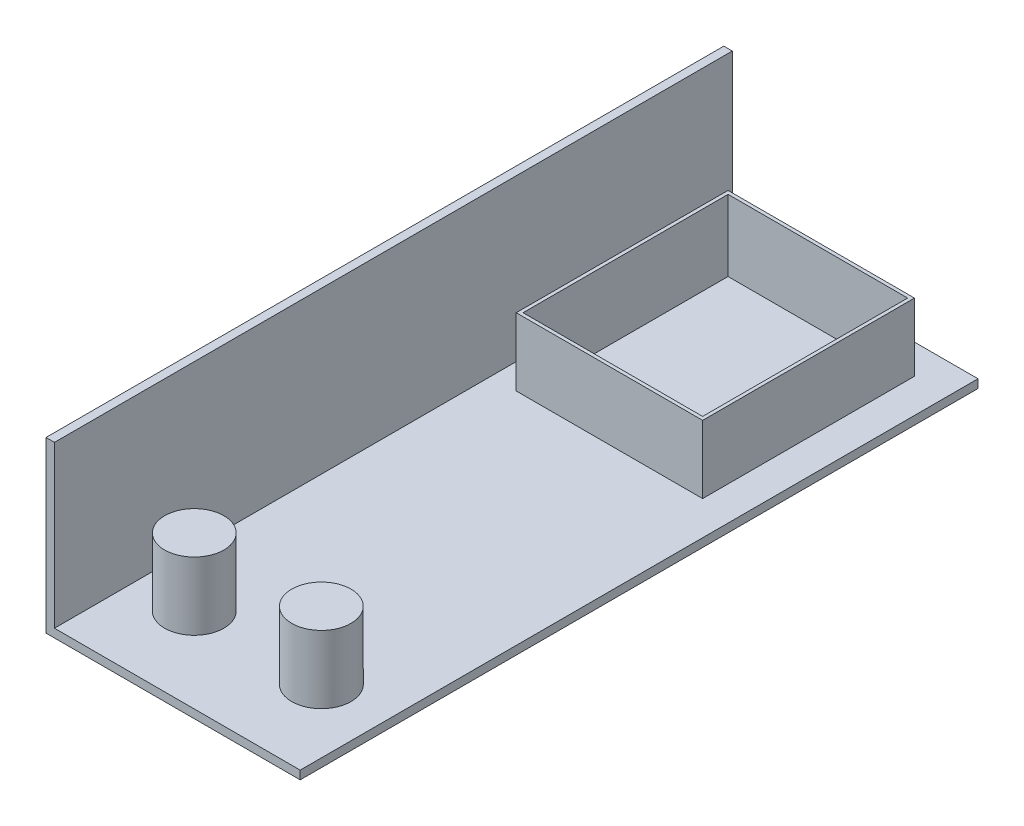
ISO-10303-21;
HEADER;
FILE_DESCRIPTION(('STEP AP214'),'2;1');
FILE_NAME('part.step','',(''),(''),'','','');
FILE_SCHEMA(('AUTOMOTIVE_DESIGN { 1 0 10303 214 1 1 1 1 }'));
ENDSEC;
DATA;
#1=APPLICATION_CONTEXT('core data for automotive mechanical design processes');
#2=APPLICATION_PROTOCOL_DEFINITION('international standard','automotive_design',2000,#1);
#3=PRODUCT_CONTEXT('',#1,'mechanical');
#4=PRODUCT('Part','Part','',(#3));
#5=PRODUCT_RELATED_PRODUCT_CATEGORY('part','',(#4));
#6=PRODUCT_DEFINITION_FORMATION('','',#4);
#7=PRODUCT_DEFINITION_CONTEXT('part definition',#1,'design');
#8=PRODUCT_DEFINITION('design','',#6,#7);
#9=PRODUCT_DEFINITION_SHAPE('','',#8);
#10=(LENGTH_UNIT() NAMED_UNIT(*) SI_UNIT(.MILLI.,.METRE.));
#11=(NAMED_UNIT(*) PLANE_ANGLE_UNIT() SI_UNIT($,.RADIAN.));
#12=(NAMED_UNIT(*) SI_UNIT($,.STERADIAN.) SOLID_ANGLE_UNIT());
#13=UNCERTAINTY_MEASURE_WITH_UNIT(LENGTH_MEASURE(1.E-05),#10,'distance_accuracy_value','');
#14=(GEOMETRIC_REPRESENTATION_CONTEXT(3) GLOBAL_UNCERTAINTY_ASSIGNED_CONTEXT((#13)) GLOBAL_UNIT_ASSIGNED_CONTEXT((#10,
#11,#12)) REPRESENTATION_CONTEXT('',''));
#15=CARTESIAN_POINT('',(0.,0.,0.));
#16=DIRECTION('',(0.,0.,1.));
#17=DIRECTION('',(1.,0.,0.));
#18=AXIS2_PLACEMENT_3D('',#15,#16,#17);
#19=CARTESIAN_POINT('',(0.,45.,0.));
#20=DIRECTION('',(0.,-1.,0.));
#21=DIRECTION('',(1.,0.,0.));
#22=AXIS2_PLACEMENT_3D('',#19,#20,#21);
#23=PLANE('',#22);
#24=DIRECTION('',(0.,0.,-1.));
#25=VECTOR('',#24,1.);
#26=CARTESIAN_POINT('',(55.,45.,-57.5));
#27=LINE('',#26,#25);
#28=CARTESIAN_POINT('',(55.,45.,-57.5));
#29=VERTEX_POINT('',#28);
#30=CARTESIAN_POINT('',(55.,45.,-182.5));
#31=VERTEX_POINT('',#30);
#32=EDGE_CURVE('E230',#29,#31,#27,.T.);
#33=ORIENTED_EDGE('',*,*,#32,.T.);
#34=DIRECTION('',(-1.,0.,0.));
#35=VECTOR('',#34,1.);
#36=CARTESIAN_POINT('',(-55.,45.,-182.5));
#37=LINE('',#36,#35);
#38=CARTESIAN_POINT('',(-55.,45.,-182.5));
#39=VERTEX_POINT('',#38);
#40=EDGE_CURVE('E233',#31,#39,#37,.T.);
#41=ORIENTED_EDGE('',*,*,#40,.T.);
#42=DIRECTION('',(0.,0.,1.));
#43=VECTOR('',#42,1.);
#44=CARTESIAN_POINT('',(-55.,45.,-57.5));
#45=LINE('',#44,#43);
#46=CARTESIAN_POINT('',(-55.,45.,-57.5));
#47=VERTEX_POINT('',#46);
#48=EDGE_CURVE('E236',#39,#47,#45,.T.);
#49=ORIENTED_EDGE('',*,*,#48,.T.);
#50=DIRECTION('',(1.,0.,0.));
#51=VECTOR('',#50,1.);
#52=CARTESIAN_POINT('',(-55.,45.,-57.5));
#53=LINE('',#52,#51);
#54=EDGE_CURVE('E238',#47,#29,#53,.T.);
#55=ORIENTED_EDGE('',*,*,#54,.T.);
#56=EDGE_LOOP('',(#33,#41,#49,#55));
#57=FACE_BOUND('',#56,.T.);
#58=DIRECTION('',(0.,0.,-1.));
#59=VECTOR('',#58,1.);
#60=CARTESIAN_POINT('',(53.,45.,0.));
#61=LINE('',#60,#59);
#62=CARTESIAN_POINT('',(53.,45.,-59.5));
#63=VERTEX_POINT('',#62);
#64=CARTESIAN_POINT('',(53.,45.,-180.5));
#65=VERTEX_POINT('',#64);
#66=EDGE_CURVE('E222',#63,#65,#61,.T.);
#67=ORIENTED_EDGE('',*,*,#66,.F.);
#68=DIRECTION('',(1.,0.,0.));
#69=VECTOR('',#68,1.);
#70=CARTESIAN_POINT('',(0.,45.,-59.5));
#71=LINE('',#70,#69);
#72=CARTESIAN_POINT('',(-53.,45.,-59.5));
#73=VERTEX_POINT('',#72);
#74=EDGE_CURVE('E218',#73,#63,#71,.T.);
#75=ORIENTED_EDGE('',*,*,#74,.F.);
#76=DIRECTION('',(0.,0.,1.));
#77=VECTOR('',#76,1.);
#78=CARTESIAN_POINT('',(-53.,45.,0.));
#79=LINE('',#78,#77);
#80=CARTESIAN_POINT('',(-53.,45.,-180.5));
#81=VERTEX_POINT('',#80);
#82=EDGE_CURVE('E227',#81,#73,#79,.T.);
#83=ORIENTED_EDGE('',*,*,#82,.F.);
#84=DIRECTION('',(-1.,0.,0.));
#85=VECTOR('',#84,1.);
#86=CARTESIAN_POINT('',(0.,45.,-180.5));
#87=LINE('',#86,#85);
#88=EDGE_CURVE('E224',#65,#81,#87,.T.);
#89=ORIENTED_EDGE('',*,*,#88,.F.);
#90=EDGE_LOOP('',(#67,#75,#83,#89));
#91=FACE_BOUND('',#90,.T.);
#92=ADVANCED_FACE('F32',(#57,#91),#23,.F.);
#93=CARTESIAN_POINT('',(75.,5.,200.));
#94=DIRECTION('',(0.,-1.,0.));
#95=DIRECTION('',(1.,0.,0.));
#96=AXIS2_PLACEMENT_3D('',#93,#94,#95);
#97=PLANE('',#96);
#98=CARTESIAN_POINT('',(-37.5,4.99999999999999,150.));
#99=DIRECTION('',(0.,-1.,0.));
#100=DIRECTION('',(1.,0.,0.));
#101=AXIS2_PLACEMENT_3D('',#98,#99,#100);
#102=CIRCLE('',#101,17.5);
#103=CARTESIAN_POINT('',(-20.,4.99999999999999,150.));
#104=VERTEX_POINT('',#103);
#105=EDGE_CURVE('E11',#104,#104,#102,.F.);
#106=ORIENTED_EDGE('',*,*,#105,.F.);
#107=EDGE_LOOP('',(#106));
#108=FACE_BOUND('',#107,.T.);
#109=DIRECTION('',(-1.,0.,0.));
#110=VECTOR('',#109,1.);
#111=CARTESIAN_POINT('',(75.,5.,-200.));
#112=LINE('',#111,#110);
#113=CARTESIAN_POINT('',(75.,5.,-200.));
#114=VERTEX_POINT('',#113);
#115=CARTESIAN_POINT('',(-70.,4.99999999999999,-200.));
#116=VERTEX_POINT('',#115);
#117=EDGE_CURVE('E291',#114,#116,#112,.T.);
#118=ORIENTED_EDGE('',*,*,#117,.T.);
#119=DIRECTION('',(0.,0.,-1.));
#120=VECTOR('',#119,1.);
#121=CARTESIAN_POINT('',(-70.,4.99999999999999,200.));
#122=LINE('',#121,#120);
#123=CARTESIAN_POINT('',(-70.,4.99999999999999,200.));
#124=VERTEX_POINT('',#123);
#125=EDGE_CURVE('E296',#124,#116,#122,.T.);
#126=ORIENTED_EDGE('',*,*,#125,.F.);
#127=DIRECTION('',(-1.,0.,0.));
#128=VECTOR('',#127,1.);
#129=CARTESIAN_POINT('',(75.,5.,200.));
#130=LINE('',#129,#128);
#131=CARTESIAN_POINT('',(75.,5.,200.));
#132=VERTEX_POINT('',#131);
#133=EDGE_CURVE('E278',#132,#124,#130,.T.);
#134=ORIENTED_EDGE('',*,*,#133,.F.);
#135=DIRECTION('',(0.,0.,-1.));
#136=VECTOR('',#135,1.);
#137=CARTESIAN_POINT('',(75.,5.,200.));
#138=LINE('',#137,#136);
#139=EDGE_CURVE('E299',#132,#114,#138,.T.);
#140=ORIENTED_EDGE('',*,*,#139,.T.);
#141=EDGE_LOOP('',(#118,#126,#134,#140));
#142=FACE_BOUND('',#141,.T.);
#143=CARTESIAN_POINT('',(37.5,5.,150.));
#144=DIRECTION('',(0.,-1.,0.));
#145=DIRECTION('',(1.,0.,0.));
#146=AXIS2_PLACEMENT_3D('',#143,#144,#145);
#147=CIRCLE('',#146,17.5);
#148=CARTESIAN_POINT('',(55.,5.,150.));
#149=VERTEX_POINT('',#148);
#150=EDGE_CURVE('E40',#149,#149,#147,.F.);
#151=ORIENTED_EDGE('',*,*,#150,.F.);
#152=EDGE_LOOP('',(#151));
#153=FACE_BOUND('',#152,.T.);
#154=DIRECTION('',(0.,0.,-1.));
#155=VECTOR('',#154,1.);
#156=CARTESIAN_POINT('',(55.,5.,-57.5));
#157=LINE('',#156,#155);
#158=CARTESIAN_POINT('',(55.,5.,-57.5));
#159=VERTEX_POINT('',#158);
#160=CARTESIAN_POINT('',(55.,5.,-182.5));
#161=VERTEX_POINT('',#160);
#162=EDGE_CURVE('E241',#159,#161,#157,.T.);
#163=ORIENTED_EDGE('',*,*,#162,.F.);
#164=DIRECTION('',(1.,0.,0.));
#165=VECTOR('',#164,1.);
#166=CARTESIAN_POINT('',(-55.,4.99999999999999,-57.5));
#167=LINE('',#166,#165);
#168=CARTESIAN_POINT('',(-55.,4.99999999999999,-57.5));
#169=VERTEX_POINT('',#168);
#170=EDGE_CURVE('E234',#169,#159,#167,.T.);
#171=ORIENTED_EDGE('',*,*,#170,.F.);
#172=DIRECTION('',(0.,0.,1.));
#173=VECTOR('',#172,1.);
#174=CARTESIAN_POINT('',(-55.,4.99999999999999,-57.5));
#175=LINE('',#174,#173);
#176=CARTESIAN_POINT('',(-55.,4.99999999999999,-182.5));
#177=VERTEX_POINT('',#176);
#178=EDGE_CURVE('E246',#177,#169,#175,.T.);
#179=ORIENTED_EDGE('',*,*,#178,.F.);
#180=DIRECTION('',(-1.,0.,0.));
#181=VECTOR('',#180,1.);
#182=CARTESIAN_POINT('',(-55.,4.99999999999999,-182.5));
#183=LINE('',#182,#181);
#184=EDGE_CURVE('E55',#161,#177,#183,.T.);
#185=ORIENTED_EDGE('',*,*,#184,.F.);
#186=EDGE_LOOP('',(#163,#171,#179,#185));
#187=FACE_BOUND('',#186,.T.);
#188=ADVANCED_FACE('F315',(#108,#142,#153,#187),#97,.F.);
#189=CARTESIAN_POINT('',(-70.,100.,200.));
#190=DIRECTION('',(0.,-1.,0.));
#191=DIRECTION('',(1.,0.,0.));
#192=AXIS2_PLACEMENT_3D('',#189,#190,#191);
#193=PLANE('',#192);
#194=DIRECTION('',(-1.,0.,0.));
#195=VECTOR('',#194,1.);
#196=CARTESIAN_POINT('',(-70.,100.,-200.));
#197=LINE('',#196,#195);
#198=CARTESIAN_POINT('',(-70.,100.,-200.));
#199=VERTEX_POINT('',#198);
#200=CARTESIAN_POINT('',(-75.,100.,-200.));
#201=VERTEX_POINT('',#200);
#202=EDGE_CURVE('E267',#199,#201,#197,.T.);
#203=ORIENTED_EDGE('',*,*,#202,.T.);
#204=DIRECTION('',(0.,0.,-1.));
#205=VECTOR('',#204,1.);
#206=CARTESIAN_POINT('',(-75.,100.,200.));
#207=LINE('',#206,#205);
#208=CARTESIAN_POINT('',(-75.,100.,200.));
#209=VERTEX_POINT('',#208);
#210=EDGE_CURVE('E308',#209,#201,#207,.T.);
#211=ORIENTED_EDGE('',*,*,#210,.F.);
#212=DIRECTION('',(-1.,0.,0.));
#213=VECTOR('',#212,1.);
#214=CARTESIAN_POINT('',(-70.,100.,200.));
#215=LINE('',#214,#213);
#216=CARTESIAN_POINT('',(-70.,100.,200.));
#217=VERTEX_POINT('',#216);
#218=EDGE_CURVE('E268',#217,#209,#215,.T.);
#219=ORIENTED_EDGE('',*,*,#218,.F.);
#220=DIRECTION('',(0.,0.,-1.));
#221=VECTOR('',#220,1.);
#222=CARTESIAN_POINT('',(-70.,100.,200.));
#223=LINE('',#222,#221);
#224=EDGE_CURVE('E282',#217,#199,#223,.T.);
#225=ORIENTED_EDGE('',*,*,#224,.T.);
#226=EDGE_LOOP('',(#203,#211,#219,#225));
#227=FACE_BOUND('',#226,.T.);
#228=ADVANCED_FACE('F34',(#227),#193,.F.);
#229=CARTESIAN_POINT('',(-75.,100.,200.));
#230=DIRECTION('',(1.,0.,0.));
#231=DIRECTION('',(0.,1.,0.));
#232=AXIS2_PLACEMENT_3D('',#229,#230,#231);
#233=PLANE('',#232);
#234=DIRECTION('',(0.,-1.,0.));
#235=VECTOR('',#234,1.);
#236=CARTESIAN_POINT('',(-75.,100.,-200.));
#237=LINE('',#236,#235);
#238=CARTESIAN_POINT('',(-75.,0.,-200.));
#239=VERTEX_POINT('',#238);
#240=EDGE_CURVE('E285',#201,#239,#237,.T.);
#241=ORIENTED_EDGE('',*,*,#240,.T.);
#242=DIRECTION('',(0.,0.,-1.));
#243=VECTOR('',#242,1.);
#244=CARTESIAN_POINT('',(-75.,0.,200.));
#245=LINE('',#244,#243);
#246=CARTESIAN_POINT('',(-75.,0.,200.));
#247=VERTEX_POINT('',#246);
#248=EDGE_CURVE('E305',#247,#239,#245,.T.);
#249=ORIENTED_EDGE('',*,*,#248,.F.);
#250=DIRECTION('',(0.,-1.,0.));
#251=VECTOR('',#250,1.);
#252=CARTESIAN_POINT('',(-75.,100.,200.));
#253=LINE('',#252,#251);
#254=EDGE_CURVE('E271',#209,#247,#253,.T.);
#255=ORIENTED_EDGE('',*,*,#254,.F.);
#256=ORIENTED_EDGE('',*,*,#210,.T.);
#257=EDGE_LOOP('',(#241,#249,#255,#256));
#258=FACE_BOUND('',#257,.T.);
#259=ADVANCED_FACE('F679',(#258),#233,.F.);
#260=CARTESIAN_POINT('',(-75.,0.,200.));
#261=DIRECTION('',(0.,1.,0.));
#262=DIRECTION('',(-1.,0.,0.));
#263=AXIS2_PLACEMENT_3D('',#260,#261,#262);
#264=PLANE('',#263);
#265=DIRECTION('',(1.,0.,0.));
#266=VECTOR('',#265,1.);
#267=CARTESIAN_POINT('',(-75.,0.,-200.));
#268=LINE('',#267,#266);
#269=CARTESIAN_POINT('',(75.,0.,-200.));
#270=VERTEX_POINT('',#269);
#271=EDGE_CURVE('E287',#239,#270,#268,.T.);
#272=ORIENTED_EDGE('',*,*,#271,.T.);
#273=DIRECTION('',(0.,0.,-1.));
#274=VECTOR('',#273,1.);
#275=CARTESIAN_POINT('',(75.,0.,200.));
#276=LINE('',#275,#274);
#277=CARTESIAN_POINT('',(75.,0.,200.));
#278=VERTEX_POINT('',#277);
#279=EDGE_CURVE('E302',#278,#270,#276,.T.);
#280=ORIENTED_EDGE('',*,*,#279,.F.);
#281=DIRECTION('',(1.,0.,0.));
#282=VECTOR('',#281,1.);
#283=CARTESIAN_POINT('',(-75.,0.,200.));
#284=LINE('',#283,#282);
#285=EDGE_CURVE('E274',#247,#278,#284,.T.);
#286=ORIENTED_EDGE('',*,*,#285,.F.);
#287=ORIENTED_EDGE('',*,*,#248,.T.);
#288=EDGE_LOOP('',(#272,#280,#286,#287));
#289=FACE_BOUND('',#288,.T.);
#290=ADVANCED_FACE('F669',(#289),#264,.F.);
#291=CARTESIAN_POINT('',(75.,5.,200.));
#292=DIRECTION('',(-1.,0.,0.));
#293=DIRECTION('',(0.,0.,1.));
#294=AXIS2_PLACEMENT_3D('',#291,#292,#293);
#295=PLANE('',#294);
#296=DIRECTION('',(0.,1.,0.));
#297=VECTOR('',#296,1.);
#298=CARTESIAN_POINT('',(75.,5.,-200.));
#299=LINE('',#298,#297);
#300=EDGE_CURVE('E289',#270,#114,#299,.T.);
#301=ORIENTED_EDGE('',*,*,#300,.T.);
#302=ORIENTED_EDGE('',*,*,#139,.F.);
#303=DIRECTION('',(0.,1.,0.));
#304=VECTOR('',#303,1.);
#305=CARTESIAN_POINT('',(75.,5.,200.));
#306=LINE('',#305,#304);
#307=EDGE_CURVE('E276',#278,#132,#306,.T.);
#308=ORIENTED_EDGE('',*,*,#307,.F.);
#309=ORIENTED_EDGE('',*,*,#279,.T.);
#310=EDGE_LOOP('',(#301,#302,#308,#309));
#311=FACE_BOUND('',#310,.T.);
#312=ADVANCED_FACE('F659',(#311),#295,.F.);
#313=CARTESIAN_POINT('',(-70.,4.99999999999999,200.));
#314=DIRECTION('',(-1.,0.,0.));
#315=DIRECTION('',(0.,0.,1.));
#316=AXIS2_PLACEMENT_3D('',#313,#314,#315);
#317=PLANE('',#316);
#318=DIRECTION('',(0.,1.,0.));
#319=VECTOR('',#318,1.);
#320=CARTESIAN_POINT('',(-70.,4.99999999999999,-200.));
#321=LINE('',#320,#319);
#322=EDGE_CURVE('E272',#116,#199,#321,.T.);
#323=ORIENTED_EDGE('',*,*,#322,.T.);
#324=ORIENTED_EDGE('',*,*,#224,.F.);
#325=DIRECTION('',(0.,1.,0.));
#326=VECTOR('',#325,1.);
#327=CARTESIAN_POINT('',(-70.,4.99999999999999,200.));
#328=LINE('',#327,#326);
#329=EDGE_CURVE('E280',#124,#217,#328,.T.);
#330=ORIENTED_EDGE('',*,*,#329,.F.);
#331=ORIENTED_EDGE('',*,*,#125,.T.);
#332=EDGE_LOOP('',(#323,#324,#330,#331));
#333=FACE_BOUND('',#332,.T.);
#334=ADVANCED_FACE('F649',(#333),#317,.F.);
#335=CARTESIAN_POINT('',(0.,0.,200.));
#336=DIRECTION('',(0.,0.,1.));
#337=DIRECTION('',(1.,0.,0.));
#338=AXIS2_PLACEMENT_3D('',#335,#336,#337);
#339=PLANE('',#338);
#340=ORIENTED_EDGE('',*,*,#218,.T.);
#341=ORIENTED_EDGE('',*,*,#254,.T.);
#342=ORIENTED_EDGE('',*,*,#285,.T.);
#343=ORIENTED_EDGE('',*,*,#307,.T.);
#344=ORIENTED_EDGE('',*,*,#133,.T.);
#345=ORIENTED_EDGE('',*,*,#329,.T.);
#346=EDGE_LOOP('',(#340,#341,#342,#343,#344,#345));
#347=FACE_BOUND('',#346,.T.);
#348=ADVANCED_FACE('F639',(#347),#339,.T.);
#349=CARTESIAN_POINT('',(0.,0.,-200.));
#350=DIRECTION('',(0.,0.,1.));
#351=DIRECTION('',(1.,0.,0.));
#352=AXIS2_PLACEMENT_3D('',#349,#350,#351);
#353=PLANE('',#352);
#354=ORIENTED_EDGE('',*,*,#202,.F.);
#355=ORIENTED_EDGE('',*,*,#322,.F.);
#356=ORIENTED_EDGE('',*,*,#117,.F.);
#357=ORIENTED_EDGE('',*,*,#300,.F.);
#358=ORIENTED_EDGE('',*,*,#271,.F.);
#359=ORIENTED_EDGE('',*,*,#240,.F.);
#360=EDGE_LOOP('',(#354,#355,#356,#357,#358,#359));
#361=FACE_BOUND('',#360,.T.);
#362=ADVANCED_FACE('F629',(#361),#353,.F.);
#363=CARTESIAN_POINT('',(37.5,45.,150.));
#364=DIRECTION('',(0.,-1.,0.));
#365=DIRECTION('',(1.,0.,0.));
#366=AXIS2_PLACEMENT_3D('',#363,#364,#365);
#367=CYLINDRICAL_SURFACE('',#366,17.5);
#368=CARTESIAN_POINT('',(37.5,45.,150.));
#369=DIRECTION('',(0.,1.,0.));
#370=DIRECTION('',(-1.,0.,0.));
#371=AXIS2_PLACEMENT_3D('',#368,#369,#370);
#372=CIRCLE('',#371,17.5);
#373=CARTESIAN_POINT('',(20.,45.,150.));
#374=VERTEX_POINT('',#373);
#375=EDGE_CURVE('E264',#374,#374,#372,.T.);
#376=ORIENTED_EDGE('',*,*,#375,.F.);
#377=EDGE_LOOP('',(#376));
#378=FACE_BOUND('',#377,.T.);
#379=ORIENTED_EDGE('',*,*,#150,.T.);
#380=EDGE_LOOP('',(#379));
#381=FACE_BOUND('',#380,.T.);
#382=ADVANCED_FACE('F313',(#378,#381),#367,.T.);
#383=CARTESIAN_POINT('',(37.5,45.,150.));
#384=DIRECTION('',(0.,1.,0.));
#385=DIRECTION('',(-1.,0.,0.));
#386=AXIS2_PLACEMENT_3D('',#383,#384,#385);
#387=PLANE('',#386);
#388=ORIENTED_EDGE('',*,*,#375,.T.);
#389=EDGE_LOOP('',(#388));
#390=FACE_BOUND('',#389,.T.);
#391=ADVANCED_FACE('F610',(#390),#387,.T.);
#392=CARTESIAN_POINT('',(-37.5,45.,150.));
#393=DIRECTION('',(0.,-1.,0.));
#394=DIRECTION('',(1.,0.,0.));
#395=AXIS2_PLACEMENT_3D('',#392,#393,#394);
#396=CYLINDRICAL_SURFACE('',#395,17.5);
#397=CARTESIAN_POINT('',(-37.5,45.,150.));
#398=DIRECTION('',(0.,1.,0.));
#399=DIRECTION('',(-1.,0.,0.));
#400=AXIS2_PLACEMENT_3D('',#397,#398,#399);
#401=CIRCLE('',#400,17.5);
#402=CARTESIAN_POINT('',(-55.,45.,150.));
#403=VERTEX_POINT('',#402);
#404=EDGE_CURVE('E261',#403,#403,#401,.T.);
#405=ORIENTED_EDGE('',*,*,#404,.F.);
#406=EDGE_LOOP('',(#405));
#407=FACE_BOUND('',#406,.T.);
#408=ORIENTED_EDGE('',*,*,#105,.T.);
#409=EDGE_LOOP('',(#408));
#410=FACE_BOUND('',#409,.T.);
#411=ADVANCED_FACE('F600',(#407,#410),#396,.T.);
#412=CARTESIAN_POINT('',(-37.5,45.,150.));
#413=DIRECTION('',(0.,1.,0.));
#414=DIRECTION('',(-1.,0.,0.));
#415=AXIS2_PLACEMENT_3D('',#412,#413,#414);
#416=PLANE('',#415);
#417=ORIENTED_EDGE('',*,*,#404,.T.);
#418=EDGE_LOOP('',(#417));
#419=FACE_BOUND('',#418,.T.);
#420=ADVANCED_FACE('F343',(#419),#416,.T.);
#421=CARTESIAN_POINT('',(55.,45.,-57.5));
#422=DIRECTION('',(-1.,0.,0.));
#423=DIRECTION('',(0.,-1.,0.));
#424=AXIS2_PLACEMENT_3D('',#421,#422,#423);
#425=PLANE('',#424);
#426=ORIENTED_EDGE('',*,*,#162,.T.);
#427=DIRECTION('',(0.,-1.,0.));
#428=VECTOR('',#427,1.);
#429=CARTESIAN_POINT('',(55.,45.,-182.5));
#430=LINE('',#429,#428);
#431=EDGE_CURVE('E259',#31,#161,#430,.T.);
#432=ORIENTED_EDGE('',*,*,#431,.F.);
#433=ORIENTED_EDGE('',*,*,#32,.F.);
#434=DIRECTION('',(0.,-1.,0.));
#435=VECTOR('',#434,1.);
#436=CARTESIAN_POINT('',(55.,45.,-57.5));
#437=LINE('',#436,#435);
#438=EDGE_CURVE('E240',#29,#159,#437,.T.);
#439=ORIENTED_EDGE('',*,*,#438,.T.);
#440=EDGE_LOOP('',(#426,#432,#433,#439));
#441=FACE_BOUND('',#440,.T.);
#442=ADVANCED_FACE('F327',(#441),#425,.F.);
#443=CARTESIAN_POINT('',(-55.,45.,-182.5));
#444=DIRECTION('',(0.,0.,1.));
#445=DIRECTION('',(1.,0.,0.));
#446=AXIS2_PLACEMENT_3D('',#443,#444,#445);
#447=PLANE('',#446);
#448=ORIENTED_EDGE('',*,*,#184,.T.);
#449=DIRECTION('',(0.,-1.,0.));
#450=VECTOR('',#449,1.);
#451=CARTESIAN_POINT('',(-55.,45.,-182.5));
#452=LINE('',#451,#450);
#453=EDGE_CURVE('E256',#39,#177,#452,.T.);
#454=ORIENTED_EDGE('',*,*,#453,.F.);
#455=ORIENTED_EDGE('',*,*,#40,.F.);
#456=ORIENTED_EDGE('',*,*,#431,.T.);
#457=EDGE_LOOP('',(#448,#454,#455,#456));
#458=FACE_BOUND('',#457,.T.);
#459=ADVANCED_FACE('F335',(#458),#447,.F.);
#460=CARTESIAN_POINT('',(-55.,45.,-57.5));
#461=DIRECTION('',(1.,0.,0.));
#462=DIRECTION('',(0.,1.,0.));
#463=AXIS2_PLACEMENT_3D('',#460,#461,#462);
#464=PLANE('',#463);
#465=ORIENTED_EDGE('',*,*,#178,.T.);
#466=DIRECTION('',(0.,-1.,0.));
#467=VECTOR('',#466,1.);
#468=CARTESIAN_POINT('',(-55.,45.,-57.5));
#469=LINE('',#468,#467);
#470=EDGE_CURVE('E253',#47,#169,#469,.T.);
#471=ORIENTED_EDGE('',*,*,#470,.F.);
#472=ORIENTED_EDGE('',*,*,#48,.F.);
#473=ORIENTED_EDGE('',*,*,#453,.T.);
#474=EDGE_LOOP('',(#465,#471,#472,#473));
#475=FACE_BOUND('',#474,.T.);
#476=ADVANCED_FACE('F333',(#475),#464,.F.);
#477=CARTESIAN_POINT('',(-55.,45.,-57.5));
#478=DIRECTION('',(0.,0.,-1.));
#479=DIRECTION('',(-1.,0.,0.));
#480=AXIS2_PLACEMENT_3D('',#477,#478,#479);
#481=PLANE('',#480);
#482=ORIENTED_EDGE('',*,*,#170,.T.);
#483=ORIENTED_EDGE('',*,*,#438,.F.);
#484=ORIENTED_EDGE('',*,*,#54,.F.);
#485=ORIENTED_EDGE('',*,*,#470,.T.);
#486=EDGE_LOOP('',(#482,#483,#484,#485));
#487=FACE_BOUND('',#486,.T.);
#488=ADVANCED_FACE('F323',(#487),#481,.F.);
#489=CARTESIAN_POINT('',(75.,3.,200.));
#490=DIRECTION('',(0.,-1.,0.));
#491=DIRECTION('',(1.,0.,0.));
#492=AXIS2_PLACEMENT_3D('',#489,#490,#491);
#493=PLANE('',#492);
#494=CARTESIAN_POINT('',(-37.5,2.99999999999999,150.));
#495=DIRECTION('',(0.,-1.,0.));
#496=DIRECTION('',(1.,0.,0.));
#497=AXIS2_PLACEMENT_3D('',#494,#495,#496);
#498=CIRCLE('',#497,15.5);
#499=CARTESIAN_POINT('',(-22.,2.99999999999999,150.));
#500=VERTEX_POINT('',#499);
#501=EDGE_CURVE('E244',#500,#500,#498,.F.);
#502=ORIENTED_EDGE('',*,*,#501,.T.);
#503=EDGE_LOOP('',(#502));
#504=FACE_BOUND('',#503,.T.);
#505=DIRECTION('',(-1.,0.,0.));
#506=VECTOR('',#505,1.);
#507=CARTESIAN_POINT('',(75.,3.,-198.));
#508=LINE('',#507,#506);
#509=CARTESIAN_POINT('',(73.,3.,-198.));
#510=VERTEX_POINT('',#509);
#511=CARTESIAN_POINT('',(-72.,2.99999999999999,-198.));
#512=VERTEX_POINT('',#511);
#513=EDGE_CURVE('E168',#510,#512,#508,.T.);
#514=ORIENTED_EDGE('',*,*,#513,.F.);
#515=DIRECTION('',(0.,0.,-1.));
#516=VECTOR('',#515,1.);
#517=CARTESIAN_POINT('',(73.,3.,200.));
#518=LINE('',#517,#516);
#519=CARTESIAN_POINT('',(73.,3.,198.));
#520=VERTEX_POINT('',#519);
#521=EDGE_CURVE('E189',#520,#510,#518,.T.);
#522=ORIENTED_EDGE('',*,*,#521,.F.);
#523=DIRECTION('',(-1.,0.,0.));
#524=VECTOR('',#523,1.);
#525=CARTESIAN_POINT('',(75.,3.,198.));
#526=LINE('',#525,#524);
#527=CARTESIAN_POINT('',(-72.,2.99999999999999,198.));
#528=VERTEX_POINT('',#527);
#529=EDGE_CURVE('E186',#520,#528,#526,.T.);
#530=ORIENTED_EDGE('',*,*,#529,.T.);
#531=DIRECTION('',(0.,0.,-1.));
#532=VECTOR('',#531,1.);
#533=CARTESIAN_POINT('',(-72.,2.99999999999999,200.));
#534=LINE('',#533,#532);
#535=EDGE_CURVE('E182',#528,#512,#534,.T.);
#536=ORIENTED_EDGE('',*,*,#535,.T.);
#537=EDGE_LOOP('',(#514,#522,#530,#536));
#538=FACE_BOUND('',#537,.T.);
#539=CARTESIAN_POINT('',(37.5,3.,150.));
#540=DIRECTION('',(0.,-1.,0.));
#541=DIRECTION('',(1.,0.,0.));
#542=AXIS2_PLACEMENT_3D('',#539,#540,#541);
#543=CIRCLE('',#542,15.5);
#544=CARTESIAN_POINT('',(53.,3.,150.));
#545=VERTEX_POINT('',#544);
#546=EDGE_CURVE('E456',#545,#545,#543,.F.);
#547=ORIENTED_EDGE('',*,*,#546,.T.);
#548=EDGE_LOOP('',(#547));
#549=FACE_BOUND('',#548,.T.);
#550=DIRECTION('',(0.,0.,-1.));
#551=VECTOR('',#550,1.);
#552=CARTESIAN_POINT('',(53.,3.,200.));
#553=LINE('',#552,#551);
#554=CARTESIAN_POINT('',(53.,3.,-59.5));
#555=VERTEX_POINT('',#554);
#556=CARTESIAN_POINT('',(53.,3.,-180.5));
#557=VERTEX_POINT('',#556);
#558=EDGE_CURVE('E426',#555,#557,#553,.T.);
#559=ORIENTED_EDGE('',*,*,#558,.T.);
#560=DIRECTION('',(-1.,0.,0.));
#561=VECTOR('',#560,1.);
#562=CARTESIAN_POINT('',(75.,3.,-180.5));
#563=LINE('',#562,#561);
#564=CARTESIAN_POINT('',(-53.,2.99999999999999,-180.5));
#565=VERTEX_POINT('',#564);
#566=EDGE_CURVE('E423',#557,#565,#563,.T.);
#567=ORIENTED_EDGE('',*,*,#566,.T.);
#568=DIRECTION('',(0.,0.,1.));
#569=VECTOR('',#568,1.);
#570=CARTESIAN_POINT('',(-53.,2.99999999999999,200.));
#571=LINE('',#570,#569);
#572=CARTESIAN_POINT('',(-53.,2.99999999999999,-59.5));
#573=VERTEX_POINT('',#572);
#574=EDGE_CURVE('E418',#565,#573,#571,.T.);
#575=ORIENTED_EDGE('',*,*,#574,.T.);
#576=DIRECTION('',(1.,0.,0.));
#577=VECTOR('',#576,1.);
#578=CARTESIAN_POINT('',(75.,3.,-59.5));
#579=LINE('',#578,#577);
#580=EDGE_CURVE('E225',#573,#555,#579,.T.);
#581=ORIENTED_EDGE('',*,*,#580,.T.);
#582=EDGE_LOOP('',(#559,#567,#575,#581));
#583=FACE_BOUND('',#582,.T.);
#584=ADVANCED_FACE('F183',(#504,#538,#549,#583),#493,.T.);
#585=CARTESIAN_POINT('',(-70.,98.,200.));
#586=DIRECTION('',(0.,-1.,0.));
#587=DIRECTION('',(1.,0.,0.));
#588=AXIS2_PLACEMENT_3D('',#585,#586,#587);
#589=PLANE('',#588);
#590=DIRECTION('',(-1.,0.,0.));
#591=VECTOR('',#590,1.);
#592=CARTESIAN_POINT('',(-70.,98.,-198.));
#593=LINE('',#592,#591);
#594=CARTESIAN_POINT('',(-72.,98.,-198.));
#595=VERTEX_POINT('',#594);
#596=CARTESIAN_POINT('',(-73.,98.,-198.));
#597=VERTEX_POINT('',#596);
#598=EDGE_CURVE('E207',#595,#597,#593,.T.);
#599=ORIENTED_EDGE('',*,*,#598,.F.);
#600=DIRECTION('',(0.,0.,-1.));
#601=VECTOR('',#600,1.);
#602=CARTESIAN_POINT('',(-72.,98.,200.));
#603=LINE('',#602,#601);
#604=CARTESIAN_POINT('',(-72.,98.,198.));
#605=VERTEX_POINT('',#604);
#606=EDGE_CURVE('E190',#605,#595,#603,.T.);
#607=ORIENTED_EDGE('',*,*,#606,.F.);
#608=DIRECTION('',(-1.,0.,0.));
#609=VECTOR('',#608,1.);
#610=CARTESIAN_POINT('',(-70.,98.,198.));
#611=LINE('',#610,#609);
#612=CARTESIAN_POINT('',(-73.,98.,198.));
#613=VERTEX_POINT('',#612);
#614=EDGE_CURVE('E195',#605,#613,#611,.T.);
#615=ORIENTED_EDGE('',*,*,#614,.T.);
#616=DIRECTION('',(0.,0.,-1.));
#617=VECTOR('',#616,1.);
#618=CARTESIAN_POINT('',(-73.,98.,200.));
#619=LINE('',#618,#617);
#620=EDGE_CURVE('E451',#613,#597,#619,.T.);
#621=ORIENTED_EDGE('',*,*,#620,.T.);
#622=EDGE_LOOP('',(#599,#607,#615,#621));
#623=FACE_BOUND('',#622,.T.);
#624=ADVANCED_FACE('F357',(#623),#589,.T.);
#625=CARTESIAN_POINT('',(-73.,100.,200.));
#626=DIRECTION('',(1.,0.,0.));
#627=DIRECTION('',(0.,1.,0.));
#628=AXIS2_PLACEMENT_3D('',#625,#626,#627);
#629=PLANE('',#628);
#630=DIRECTION('',(0.,-1.,0.));
#631=VECTOR('',#630,1.);
#632=CARTESIAN_POINT('',(-73.,100.,-198.));
#633=LINE('',#632,#631);
#634=CARTESIAN_POINT('',(-73.,2.,-198.));
#635=VERTEX_POINT('',#634);
#636=EDGE_CURVE('E447',#597,#635,#633,.T.);
#637=ORIENTED_EDGE('',*,*,#636,.F.);
#638=ORIENTED_EDGE('',*,*,#620,.F.);
#639=DIRECTION('',(0.,-1.,0.));
#640=VECTOR('',#639,1.);
#641=CARTESIAN_POINT('',(-73.,100.,198.));
#642=LINE('',#641,#640);
#643=CARTESIAN_POINT('',(-73.,2.,198.));
#644=VERTEX_POINT('',#643);
#645=EDGE_CURVE('E198',#613,#644,#642,.T.);
#646=ORIENTED_EDGE('',*,*,#645,.T.);
#647=DIRECTION('',(0.,0.,-1.));
#648=VECTOR('',#647,1.);
#649=CARTESIAN_POINT('',(-73.,2.,200.));
#650=LINE('',#649,#648);
#651=EDGE_CURVE('E445',#644,#635,#650,.T.);
#652=ORIENTED_EDGE('',*,*,#651,.T.);
#653=EDGE_LOOP('',(#637,#638,#646,#652));
#654=FACE_BOUND('',#653,.T.);
#655=ADVANCED_FACE('F363',(#654),#629,.T.);
#656=CARTESIAN_POINT('',(-75.,2.,200.));
#657=DIRECTION('',(0.,1.,0.));
#658=DIRECTION('',(-1.,0.,0.));
#659=AXIS2_PLACEMENT_3D('',#656,#657,#658);
#660=PLANE('',#659);
#661=DIRECTION('',(1.,0.,0.));
#662=VECTOR('',#661,1.);
#663=CARTESIAN_POINT('',(-75.,2.,-198.));
#664=LINE('',#663,#662);
#665=CARTESIAN_POINT('',(73.,2.00000000000003,-198.));
#666=VERTEX_POINT('',#665);
#667=EDGE_CURVE('E438',#635,#666,#664,.T.);
#668=ORIENTED_EDGE('',*,*,#667,.F.);
#669=ORIENTED_EDGE('',*,*,#651,.F.);
#670=DIRECTION('',(1.,0.,0.));
#671=VECTOR('',#670,1.);
#672=CARTESIAN_POINT('',(-75.,2.,198.));
#673=LINE('',#672,#671);
#674=CARTESIAN_POINT('',(73.,2.00000000000003,198.));
#675=VERTEX_POINT('',#674);
#676=EDGE_CURVE('E441',#644,#675,#673,.T.);
#677=ORIENTED_EDGE('',*,*,#676,.T.);
#678=DIRECTION('',(0.,0.,-1.));
#679=VECTOR('',#678,1.);
#680=CARTESIAN_POINT('',(73.,2.00000000000003,200.));
#681=LINE('',#680,#679);
#682=EDGE_CURVE('E442',#675,#666,#681,.T.);
#683=ORIENTED_EDGE('',*,*,#682,.T.);
#684=EDGE_LOOP('',(#668,#669,#677,#683));
#685=FACE_BOUND('',#684,.T.);
#686=ADVANCED_FACE('F370',(#685),#660,.T.);
#687=CARTESIAN_POINT('',(73.,5.,200.));
#688=DIRECTION('',(-1.,0.,0.));
#689=DIRECTION('',(0.,0.,1.));
#690=AXIS2_PLACEMENT_3D('',#687,#688,#689);
#691=PLANE('',#690);
#692=DIRECTION('',(0.,1.,0.));
#693=VECTOR('',#692,1.);
#694=CARTESIAN_POINT('',(73.,5.,-198.));
#695=LINE('',#694,#693);
#696=EDGE_CURVE('E176',#666,#510,#695,.T.);
#697=ORIENTED_EDGE('',*,*,#696,.F.);
#698=ORIENTED_EDGE('',*,*,#682,.F.);
#699=DIRECTION('',(0.,1.,0.));
#700=VECTOR('',#699,1.);
#701=CARTESIAN_POINT('',(73.,5.,198.));
#702=LINE('',#701,#700);
#703=EDGE_CURVE('E439',#675,#520,#702,.T.);
#704=ORIENTED_EDGE('',*,*,#703,.T.);
#705=ORIENTED_EDGE('',*,*,#521,.T.);
#706=EDGE_LOOP('',(#697,#698,#704,#705));
#707=FACE_BOUND('',#706,.T.);
#708=ADVANCED_FACE('F374',(#707),#691,.T.);
#709=CARTESIAN_POINT('',(-72.,4.99999999999999,200.));
#710=DIRECTION('',(-1.,0.,0.));
#711=DIRECTION('',(0.,0.,1.));
#712=AXIS2_PLACEMENT_3D('',#709,#710,#711);
#713=PLANE('',#712);
#714=DIRECTION('',(0.,1.,0.));
#715=VECTOR('',#714,1.);
#716=CARTESIAN_POINT('',(-72.,4.99999999999999,-198.));
#717=LINE('',#716,#715);
#718=EDGE_CURVE('E173',#512,#595,#717,.T.);
#719=ORIENTED_EDGE('',*,*,#718,.F.);
#720=ORIENTED_EDGE('',*,*,#535,.F.);
#721=DIRECTION('',(0.,1.,0.));
#722=VECTOR('',#721,1.);
#723=CARTESIAN_POINT('',(-72.,4.99999999999999,198.));
#724=LINE('',#723,#722);
#725=EDGE_CURVE('E202',#528,#605,#724,.T.);
#726=ORIENTED_EDGE('',*,*,#725,.T.);
#727=ORIENTED_EDGE('',*,*,#606,.T.);
#728=EDGE_LOOP('',(#719,#720,#726,#727));
#729=FACE_BOUND('',#728,.T.);
#730=ADVANCED_FACE('F192',(#729),#713,.T.);
#731=CARTESIAN_POINT('',(0.,0.,198.));
#732=DIRECTION('',(0.,0.,1.));
#733=DIRECTION('',(1.,0.,0.));
#734=AXIS2_PLACEMENT_3D('',#731,#732,#733);
#735=PLANE('',#734);
#736=ORIENTED_EDGE('',*,*,#614,.F.);
#737=ORIENTED_EDGE('',*,*,#725,.F.);
#738=ORIENTED_EDGE('',*,*,#529,.F.);
#739=ORIENTED_EDGE('',*,*,#703,.F.);
#740=ORIENTED_EDGE('',*,*,#676,.F.);
#741=ORIENTED_EDGE('',*,*,#645,.F.);
#742=EDGE_LOOP('',(#736,#737,#738,#739,#740,#741));
#743=FACE_BOUND('',#742,.T.);
#744=ADVANCED_FACE('F381',(#743),#735,.F.);
#745=CARTESIAN_POINT('',(0.,0.,-198.));
#746=DIRECTION('',(0.,0.,1.));
#747=DIRECTION('',(1.,0.,0.));
#748=AXIS2_PLACEMENT_3D('',#745,#746,#747);
#749=PLANE('',#748);
#750=ORIENTED_EDGE('',*,*,#598,.T.);
#751=ORIENTED_EDGE('',*,*,#636,.T.);
#752=ORIENTED_EDGE('',*,*,#667,.T.);
#753=ORIENTED_EDGE('',*,*,#696,.T.);
#754=ORIENTED_EDGE('',*,*,#513,.T.);
#755=ORIENTED_EDGE('',*,*,#718,.T.);
#756=EDGE_LOOP('',(#750,#751,#752,#753,#754,#755));
#757=FACE_BOUND('',#756,.T.);
#758=ADVANCED_FACE('F171',(#757),#749,.T.);
#759=CARTESIAN_POINT('',(37.5,45.,150.));
#760=DIRECTION('',(0.,-1.,0.));
#761=DIRECTION('',(1.,0.,0.));
#762=AXIS2_PLACEMENT_3D('',#759,#760,#761);
#763=CYLINDRICAL_SURFACE('',#762,15.5);
#764=CARTESIAN_POINT('',(37.5,43.,150.));
#765=DIRECTION('',(0.,1.,0.));
#766=DIRECTION('',(-1.,0.,0.));
#767=AXIS2_PLACEMENT_3D('',#764,#765,#766);
#768=CIRCLE('',#767,15.5);
#769=CARTESIAN_POINT('',(22.,43.,150.));
#770=VERTEX_POINT('',#769);
#771=EDGE_CURVE('E204',#770,#770,#768,.T.);
#772=ORIENTED_EDGE('',*,*,#771,.T.);
#773=EDGE_LOOP('',(#772));
#774=FACE_BOUND('',#773,.T.);
#775=ORIENTED_EDGE('',*,*,#546,.F.);
#776=EDGE_LOOP('',(#775));
#777=FACE_BOUND('',#776,.T.);
#778=ADVANCED_FACE('F387',(#774,#777),#763,.F.);
#779=CARTESIAN_POINT('',(37.5,43.,150.));
#780=DIRECTION('',(0.,1.,0.));
#781=DIRECTION('',(-1.,0.,0.));
#782=AXIS2_PLACEMENT_3D('',#779,#780,#781);
#783=PLANE('',#782);
#784=ORIENTED_EDGE('',*,*,#771,.F.);
#785=EDGE_LOOP('',(#784));
#786=FACE_BOUND('',#785,.T.);
#787=ADVANCED_FACE('F390',(#786),#783,.F.);
#788=CARTESIAN_POINT('',(-37.5,45.,150.));
#789=DIRECTION('',(0.,-1.,0.));
#790=DIRECTION('',(1.,0.,0.));
#791=AXIS2_PLACEMENT_3D('',#788,#789,#790);
#792=CYLINDRICAL_SURFACE('',#791,15.5);
#793=CARTESIAN_POINT('',(-37.5,43.,150.));
#794=DIRECTION('',(0.,1.,0.));
#795=DIRECTION('',(-1.,0.,0.));
#796=AXIS2_PLACEMENT_3D('',#793,#794,#795);
#797=CIRCLE('',#796,15.5);
#798=CARTESIAN_POINT('',(-53.,43.,150.));
#799=VERTEX_POINT('',#798);
#800=EDGE_CURVE('E208',#799,#799,#797,.T.);
#801=ORIENTED_EDGE('',*,*,#800,.T.);
#802=EDGE_LOOP('',(#801));
#803=FACE_BOUND('',#802,.T.);
#804=ORIENTED_EDGE('',*,*,#501,.F.);
#805=EDGE_LOOP('',(#804));
#806=FACE_BOUND('',#805,.T.);
#807=ADVANCED_FACE('F394',(#803,#806),#792,.F.);
#808=CARTESIAN_POINT('',(-37.5,43.,150.));
#809=DIRECTION('',(0.,1.,0.));
#810=DIRECTION('',(-1.,0.,0.));
#811=AXIS2_PLACEMENT_3D('',#808,#809,#810);
#812=PLANE('',#811);
#813=ORIENTED_EDGE('',*,*,#800,.F.);
#814=EDGE_LOOP('',(#813));
#815=FACE_BOUND('',#814,.T.);
#816=ADVANCED_FACE('F398',(#815),#812,.F.);
#817=CARTESIAN_POINT('',(53.,45.,-57.5));
#818=DIRECTION('',(-1.,0.,0.));
#819=DIRECTION('',(0.,-1.,0.));
#820=AXIS2_PLACEMENT_3D('',#817,#818,#819);
#821=PLANE('',#820);
#822=ORIENTED_EDGE('',*,*,#558,.F.);
#823=DIRECTION('',(0.,-1.,0.));
#824=VECTOR('',#823,1.);
#825=CARTESIAN_POINT('',(53.,45.,-59.5));
#826=LINE('',#825,#824);
#827=EDGE_CURVE('E215',#63,#555,#826,.T.);
#828=ORIENTED_EDGE('',*,*,#827,.F.);
#829=ORIENTED_EDGE('',*,*,#66,.T.);
#830=DIRECTION('',(0.,-1.,0.));
#831=VECTOR('',#830,1.);
#832=CARTESIAN_POINT('',(53.,45.,-180.5));
#833=LINE('',#832,#831);
#834=EDGE_CURVE('E211',#65,#557,#833,.T.);
#835=ORIENTED_EDGE('',*,*,#834,.T.);
#836=EDGE_LOOP('',(#822,#828,#829,#835));
#837=FACE_BOUND('',#836,.T.);
#838=ADVANCED_FACE('F402',(#837),#821,.T.);
#839=CARTESIAN_POINT('',(-55.,45.,-180.5));
#840=DIRECTION('',(0.,0.,1.));
#841=DIRECTION('',(1.,0.,0.));
#842=AXIS2_PLACEMENT_3D('',#839,#840,#841);
#843=PLANE('',#842);
#844=ORIENTED_EDGE('',*,*,#566,.F.);
#845=ORIENTED_EDGE('',*,*,#834,.F.);
#846=ORIENTED_EDGE('',*,*,#88,.T.);
#847=DIRECTION('',(0.,-1.,0.));
#848=VECTOR('',#847,1.);
#849=CARTESIAN_POINT('',(-53.,45.,-180.5));
#850=LINE('',#849,#848);
#851=EDGE_CURVE('E214',#81,#565,#850,.T.);
#852=ORIENTED_EDGE('',*,*,#851,.T.);
#853=EDGE_LOOP('',(#844,#845,#846,#852));
#854=FACE_BOUND('',#853,.T.);
#855=ADVANCED_FACE('F406',(#854),#843,.T.);
#856=CARTESIAN_POINT('',(-53.,45.,-57.5));
#857=DIRECTION('',(1.,0.,0.));
#858=DIRECTION('',(0.,1.,0.));
#859=AXIS2_PLACEMENT_3D('',#856,#857,#858);
#860=PLANE('',#859);
#861=ORIENTED_EDGE('',*,*,#574,.F.);
#862=ORIENTED_EDGE('',*,*,#851,.F.);
#863=ORIENTED_EDGE('',*,*,#82,.T.);
#864=DIRECTION('',(0.,-1.,0.));
#865=VECTOR('',#864,1.);
#866=CARTESIAN_POINT('',(-53.,45.,-59.5));
#867=LINE('',#866,#865);
#868=EDGE_CURVE('E47',#73,#573,#867,.T.);
#869=ORIENTED_EDGE('',*,*,#868,.T.);
#870=EDGE_LOOP('',(#861,#862,#863,#869));
#871=FACE_BOUND('',#870,.T.);
#872=ADVANCED_FACE('F409',(#871),#860,.T.);
#873=CARTESIAN_POINT('',(-55.,45.,-59.5));
#874=DIRECTION('',(0.,0.,-1.));
#875=DIRECTION('',(-1.,0.,0.));
#876=AXIS2_PLACEMENT_3D('',#873,#874,#875);
#877=PLANE('',#876);
#878=ORIENTED_EDGE('',*,*,#580,.F.);
#879=ORIENTED_EDGE('',*,*,#868,.F.);
#880=ORIENTED_EDGE('',*,*,#74,.T.);
#881=ORIENTED_EDGE('',*,*,#827,.T.);
#882=EDGE_LOOP('',(#878,#879,#880,#881));
#883=FACE_BOUND('',#882,.T.);
#884=ADVANCED_FACE('F351',(#883),#877,.T.);
#885=CLOSED_SHELL('',(#92,#188,#228,#259,#290,#312,#334,#348,#362,#382,#391,#411,#420,#442,#459,
#476,#488,#584,#624,#655,#686,#708,#730,#744,#758,#778,#787,#807,#816,#838,#855,#872,#884));
#886=MANIFOLD_SOLID_BREP('B2',#885);
#887=ADVANCED_BREP_SHAPE_REPRESENTATION('',(#18,#886),#14);
#888=SHAPE_DEFINITION_REPRESENTATION(#9,#887);
ENDSEC;
END-ISO-10303-21;
